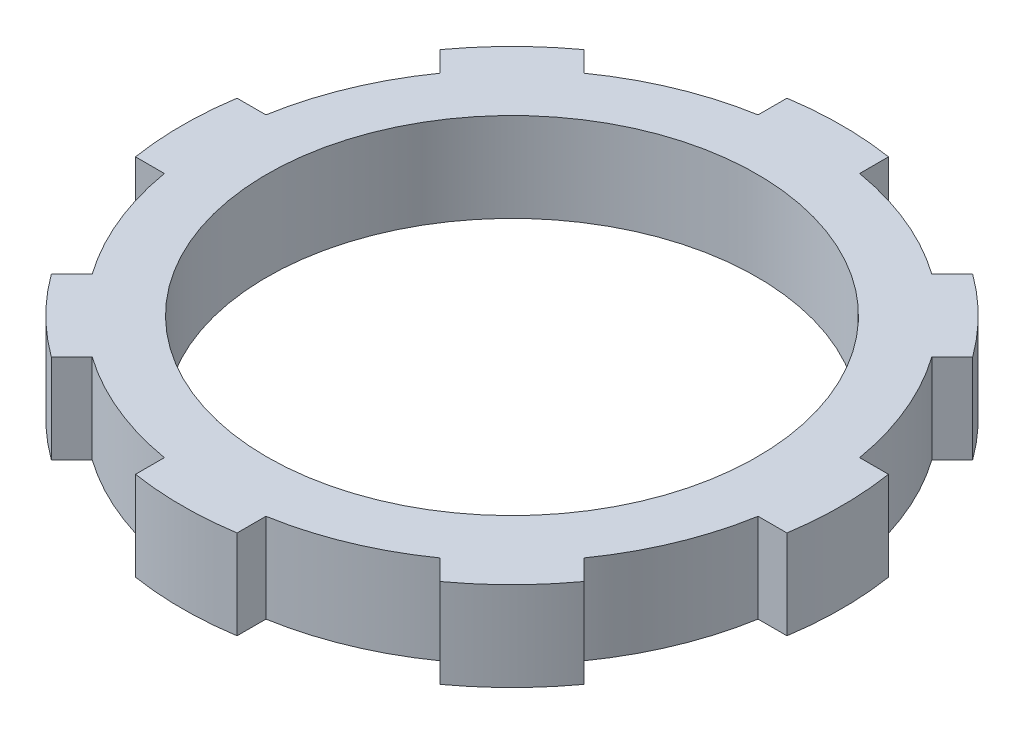
ISO-10303-21;
HEADER;
FILE_DESCRIPTION(('STEP AP214'),'2;1');
FILE_NAME('part.step','',(''),(''),'','','');
FILE_SCHEMA(('AUTOMOTIVE_DESIGN { 1 0 10303 214 1 1 1 1 }'));
ENDSEC;
DATA;
#1=APPLICATION_CONTEXT('core data for automotive mechanical design processes');
#2=APPLICATION_PROTOCOL_DEFINITION('international standard','automotive_design',2000,#1);
#3=PRODUCT_CONTEXT('',#1,'mechanical');
#4=PRODUCT('Part','Part','',(#3));
#5=PRODUCT_RELATED_PRODUCT_CATEGORY('part','',(#4));
#6=PRODUCT_DEFINITION_FORMATION('','',#4);
#7=PRODUCT_DEFINITION_CONTEXT('part definition',#1,'design');
#8=PRODUCT_DEFINITION('design','',#6,#7);
#9=PRODUCT_DEFINITION_SHAPE('','',#8);
#10=(LENGTH_UNIT() NAMED_UNIT(*) SI_UNIT(.MILLI.,.METRE.));
#11=(NAMED_UNIT(*) PLANE_ANGLE_UNIT() SI_UNIT($,.RADIAN.));
#12=(NAMED_UNIT(*) SI_UNIT($,.STERADIAN.) SOLID_ANGLE_UNIT());
#13=UNCERTAINTY_MEASURE_WITH_UNIT(LENGTH_MEASURE(1.E-05),#10,'distance_accuracy_value','');
#14=(GEOMETRIC_REPRESENTATION_CONTEXT(3) GLOBAL_UNCERTAINTY_ASSIGNED_CONTEXT((#13)) GLOBAL_UNIT_ASSIGNED_CONTEXT((#10,
#11,#12)) REPRESENTATION_CONTEXT('',''));
#15=CARTESIAN_POINT('',(0.,0.,0.));
#16=DIRECTION('',(0.,0.,1.));
#17=DIRECTION('',(1.,0.,0.));
#18=AXIS2_PLACEMENT_3D('',#15,#16,#17);
#19=CARTESIAN_POINT('',(0.,5.,0.));
#20=DIRECTION('',(0.,1.,0.));
#21=DIRECTION('',(0.,0.,1.));
#22=AXIS2_PLACEMENT_3D('',#19,#20,#21);
#23=PLANE('',#22);
#24=CARTESIAN_POINT('',(0.,5.,0.));
#25=DIRECTION('',(0.,1.,0.));
#26=DIRECTION('',(0.,0.,1.));
#27=AXIS2_PLACEMENT_3D('',#24,#25,#26);
#28=CIRCLE('',#27,18.5);
#29=CARTESIAN_POINT('',(2.85,5.,-18.2791547944646));
#30=VERTEX_POINT('',#29);
#31=CARTESIAN_POINT('',(-2.85,5.,-18.2791547944646));
#32=VERTEX_POINT('',#31);
#33=EDGE_CURVE('E338',#30,#32,#28,.T.);
#34=ORIENTED_EDGE('',*,*,#33,.T.);
#35=DIRECTION('',(0.,0.,1.));
#36=VECTOR('',#35,1.);
#37=CARTESIAN_POINT('',(-2.85,5.,-18.2791547944646));
#38=LINE('',#37,#36);
#39=CARTESIAN_POINT('',(-2.85,5.,-16.6579560570918));
#40=VERTEX_POINT('',#39);
#41=EDGE_CURVE('E166',#32,#40,#38,.T.);
#42=ORIENTED_EDGE('',*,*,#41,.T.);
#43=CARTESIAN_POINT('',(0.,5.,0.));
#44=DIRECTION('',(0.,1.,0.));
#45=DIRECTION('',(0.,0.,1.));
#46=AXIS2_PLACEMENT_3D('',#43,#44,#45);
#47=CIRCLE('',#46,16.9);
#48=CARTESIAN_POINT('',(-9.76369936229545,5.,-13.7942080150588));
#49=VERTEX_POINT('',#48);
#50=EDGE_CURVE('E425',#40,#49,#47,.T.);
#51=ORIENTED_EDGE('',*,*,#50,.T.);
#52=DIRECTION('',(-0.707106781186548,0.,-0.707106781186548));
#53=VECTOR('',#52,1.);
#54=CARTESIAN_POINT('',(-10.9100599831429,5.,-14.9405686359062));
#55=LINE('',#54,#53);
#56=CARTESIAN_POINT('',(-10.9100599831429,5.,-14.9405686359062));
#57=VERTEX_POINT('',#56);
#58=EDGE_CURVE('E444',#49,#57,#55,.T.);
#59=ORIENTED_EDGE('',*,*,#58,.T.);
#60=CARTESIAN_POINT('',(0.,5.,0.));
#61=DIRECTION('',(0.,1.,0.));
#62=DIRECTION('',(0.,0.,1.));
#63=AXIS2_PLACEMENT_3D('',#60,#61,#62);
#64=CIRCLE('',#63,18.5);
#65=CARTESIAN_POINT('',(-14.9405686359062,5.,-10.9100599831429));
#66=VERTEX_POINT('',#65);
#67=EDGE_CURVE('E441',#57,#66,#64,.T.);
#68=ORIENTED_EDGE('',*,*,#67,.T.);
#69=DIRECTION('',(0.707106781186548,0.,0.707106781186548));
#70=VECTOR('',#69,1.);
#71=CARTESIAN_POINT('',(-14.9405686359062,5.,-10.9100599831429));
#72=LINE('',#71,#70);
#73=CARTESIAN_POINT('',(-13.7942080150588,5.,-9.76369936229545));
#74=VERTEX_POINT('',#73);
#75=EDGE_CURVE('E443',#66,#74,#72,.T.);
#76=ORIENTED_EDGE('',*,*,#75,.T.);
#77=CARTESIAN_POINT('',(0.,5.,0.));
#78=DIRECTION('',(0.,1.,0.));
#79=DIRECTION('',(0.,0.,1.));
#80=AXIS2_PLACEMENT_3D('',#77,#78,#79);
#81=CIRCLE('',#80,16.9);
#82=CARTESIAN_POINT('',(-16.6579560570918,5.,-2.85));
#83=VERTEX_POINT('',#82);
#84=EDGE_CURVE('E446',#74,#83,#81,.T.);
#85=ORIENTED_EDGE('',*,*,#84,.T.);
#86=DIRECTION('',(-1.,0.,0.));
#87=VECTOR('',#86,1.);
#88=CARTESIAN_POINT('',(-18.2791547944646,5.,-2.85));
#89=LINE('',#88,#87);
#90=CARTESIAN_POINT('',(-18.2791547944646,5.,-2.85));
#91=VERTEX_POINT('',#90);
#92=EDGE_CURVE('E452',#83,#91,#89,.T.);
#93=ORIENTED_EDGE('',*,*,#92,.T.);
#94=CARTESIAN_POINT('',(0.,5.,0.));
#95=DIRECTION('',(0.,1.,0.));
#96=DIRECTION('',(0.,0.,1.));
#97=AXIS2_PLACEMENT_3D('',#94,#95,#96);
#98=CIRCLE('',#97,18.5);
#99=CARTESIAN_POINT('',(-18.2791547944646,5.,2.85));
#100=VERTEX_POINT('',#99);
#101=EDGE_CURVE('E454',#91,#100,#98,.T.);
#102=ORIENTED_EDGE('',*,*,#101,.T.);
#103=DIRECTION('',(1.,0.,0.));
#104=VECTOR('',#103,1.);
#105=CARTESIAN_POINT('',(-18.2791547944646,5.,2.85));
#106=LINE('',#105,#104);
#107=CARTESIAN_POINT('',(-16.6579560570918,5.,2.85));
#108=VERTEX_POINT('',#107);
#109=EDGE_CURVE('E456',#100,#108,#106,.T.);
#110=ORIENTED_EDGE('',*,*,#109,.T.);
#111=CARTESIAN_POINT('',(0.,5.,0.));
#112=DIRECTION('',(0.,1.,0.));
#113=DIRECTION('',(0.,0.,1.));
#114=AXIS2_PLACEMENT_3D('',#111,#112,#113);
#115=CIRCLE('',#114,16.9);
#116=CARTESIAN_POINT('',(-13.7942080150588,5.,9.76369936229545));
#117=VERTEX_POINT('',#116);
#118=EDGE_CURVE('E458',#108,#117,#115,.T.);
#119=ORIENTED_EDGE('',*,*,#118,.T.);
#120=DIRECTION('',(-0.707106781186548,0.,0.707106781186548));
#121=VECTOR('',#120,1.);
#122=CARTESIAN_POINT('',(-14.9405686359062,5.,10.9100599831429));
#123=LINE('',#122,#121);
#124=CARTESIAN_POINT('',(-14.9405686359062,5.,10.9100599831429));
#125=VERTEX_POINT('',#124);
#126=EDGE_CURVE('E460',#117,#125,#123,.T.);
#127=ORIENTED_EDGE('',*,*,#126,.T.);
#128=CARTESIAN_POINT('',(0.,5.,0.));
#129=DIRECTION('',(0.,1.,0.));
#130=DIRECTION('',(0.,0.,1.));
#131=AXIS2_PLACEMENT_3D('',#128,#129,#130);
#132=CIRCLE('',#131,18.5);
#133=CARTESIAN_POINT('',(-10.9100599831429,5.,14.9405686359062));
#134=VERTEX_POINT('',#133);
#135=EDGE_CURVE('E462',#125,#134,#132,.T.);
#136=ORIENTED_EDGE('',*,*,#135,.T.);
#137=DIRECTION('',(0.707106781186548,0.,-0.707106781186548));
#138=VECTOR('',#137,1.);
#139=CARTESIAN_POINT('',(-10.9100599831429,5.,14.9405686359062));
#140=LINE('',#139,#138);
#141=CARTESIAN_POINT('',(-9.76369936229545,5.,13.7942080150588));
#142=VERTEX_POINT('',#141);
#143=EDGE_CURVE('E464',#134,#142,#140,.T.);
#144=ORIENTED_EDGE('',*,*,#143,.T.);
#145=CARTESIAN_POINT('',(0.,5.,0.));
#146=DIRECTION('',(0.,1.,0.));
#147=DIRECTION('',(0.,0.,1.));
#148=AXIS2_PLACEMENT_3D('',#145,#146,#147);
#149=CIRCLE('',#148,16.9);
#150=CARTESIAN_POINT('',(-2.85,5.,16.6579560570918));
#151=VERTEX_POINT('',#150);
#152=EDGE_CURVE('E466',#142,#151,#149,.T.);
#153=ORIENTED_EDGE('',*,*,#152,.T.);
#154=DIRECTION('',(0.,0.,1.));
#155=VECTOR('',#154,1.);
#156=CARTESIAN_POINT('',(-2.85,5.,18.2791547944646));
#157=LINE('',#156,#155);
#158=CARTESIAN_POINT('',(-2.85,5.,18.2791547944646));
#159=VERTEX_POINT('',#158);
#160=EDGE_CURVE('E468',#151,#159,#157,.T.);
#161=ORIENTED_EDGE('',*,*,#160,.T.);
#162=CARTESIAN_POINT('',(0.,5.,0.));
#163=DIRECTION('',(0.,1.,0.));
#164=DIRECTION('',(0.,0.,1.));
#165=AXIS2_PLACEMENT_3D('',#162,#163,#164);
#166=CIRCLE('',#165,18.5);
#167=CARTESIAN_POINT('',(2.85,5.,18.2791547944646));
#168=VERTEX_POINT('',#167);
#169=EDGE_CURVE('E470',#159,#168,#166,.T.);
#170=ORIENTED_EDGE('',*,*,#169,.T.);
#171=DIRECTION('',(0.,0.,-1.));
#172=VECTOR('',#171,1.);
#173=CARTESIAN_POINT('',(2.85,5.,18.2791547944646));
#174=LINE('',#173,#172);
#175=CARTESIAN_POINT('',(2.85,5.,16.6579560570918));
#176=VERTEX_POINT('',#175);
#177=EDGE_CURVE('E472',#168,#176,#174,.T.);
#178=ORIENTED_EDGE('',*,*,#177,.T.);
#179=CARTESIAN_POINT('',(0.,5.,0.));
#180=DIRECTION('',(0.,1.,0.));
#181=DIRECTION('',(0.,0.,1.));
#182=AXIS2_PLACEMENT_3D('',#179,#180,#181);
#183=CIRCLE('',#182,16.9);
#184=CARTESIAN_POINT('',(9.76369936229544,5.,13.7942080150588));
#185=VERTEX_POINT('',#184);
#186=EDGE_CURVE('E474',#176,#185,#183,.T.);
#187=ORIENTED_EDGE('',*,*,#186,.T.);
#188=DIRECTION('',(0.707106781186548,0.,0.707106781186548));
#189=VECTOR('',#188,1.);
#190=CARTESIAN_POINT('',(10.9100599831429,5.,14.9405686359062));
#191=LINE('',#190,#189);
#192=CARTESIAN_POINT('',(10.9100599831429,5.,14.9405686359062));
#193=VERTEX_POINT('',#192);
#194=EDGE_CURVE('E476',#185,#193,#191,.T.);
#195=ORIENTED_EDGE('',*,*,#194,.T.);
#196=CARTESIAN_POINT('',(0.,5.,0.));
#197=DIRECTION('',(0.,1.,0.));
#198=DIRECTION('',(0.,0.,1.));
#199=AXIS2_PLACEMENT_3D('',#196,#197,#198);
#200=CIRCLE('',#199,18.5);
#201=CARTESIAN_POINT('',(14.9405686359062,5.,10.9100599831429));
#202=VERTEX_POINT('',#201);
#203=EDGE_CURVE('E478',#193,#202,#200,.T.);
#204=ORIENTED_EDGE('',*,*,#203,.T.);
#205=DIRECTION('',(-0.707106781186548,0.,-0.707106781186548));
#206=VECTOR('',#205,1.);
#207=CARTESIAN_POINT('',(14.9405686359062,5.,10.9100599831429));
#208=LINE('',#207,#206);
#209=CARTESIAN_POINT('',(13.7942080150588,5.,9.76369936229544));
#210=VERTEX_POINT('',#209);
#211=EDGE_CURVE('E480',#202,#210,#208,.T.);
#212=ORIENTED_EDGE('',*,*,#211,.T.);
#213=CARTESIAN_POINT('',(0.,5.,0.));
#214=DIRECTION('',(0.,1.,0.));
#215=DIRECTION('',(0.,0.,1.));
#216=AXIS2_PLACEMENT_3D('',#213,#214,#215);
#217=CIRCLE('',#216,16.9);
#218=CARTESIAN_POINT('',(16.6579560570918,5.,2.85));
#219=VERTEX_POINT('',#218);
#220=EDGE_CURVE('E482',#210,#219,#217,.T.);
#221=ORIENTED_EDGE('',*,*,#220,.T.);
#222=DIRECTION('',(1.,0.,0.));
#223=VECTOR('',#222,1.);
#224=CARTESIAN_POINT('',(18.2791547944646,5.,2.85));
#225=LINE('',#224,#223);
#226=CARTESIAN_POINT('',(18.2791547944646,5.,2.85));
#227=VERTEX_POINT('',#226);
#228=EDGE_CURVE('E484',#219,#227,#225,.T.);
#229=ORIENTED_EDGE('',*,*,#228,.T.);
#230=CARTESIAN_POINT('',(0.,5.,0.));
#231=DIRECTION('',(0.,1.,0.));
#232=DIRECTION('',(0.,0.,1.));
#233=AXIS2_PLACEMENT_3D('',#230,#231,#232);
#234=CIRCLE('',#233,18.5);
#235=CARTESIAN_POINT('',(18.2791547944646,5.,-2.85));
#236=VERTEX_POINT('',#235);
#237=EDGE_CURVE('E486',#227,#236,#234,.T.);
#238=ORIENTED_EDGE('',*,*,#237,.T.);
#239=DIRECTION('',(-1.,0.,0.));
#240=VECTOR('',#239,1.);
#241=CARTESIAN_POINT('',(18.2791547944646,5.,-2.85));
#242=LINE('',#241,#240);
#243=CARTESIAN_POINT('',(16.6579560570918,5.,-2.85));
#244=VERTEX_POINT('',#243);
#245=EDGE_CURVE('E488',#236,#244,#242,.T.);
#246=ORIENTED_EDGE('',*,*,#245,.T.);
#247=CARTESIAN_POINT('',(0.,5.,0.));
#248=DIRECTION('',(0.,1.,0.));
#249=DIRECTION('',(0.,0.,1.));
#250=AXIS2_PLACEMENT_3D('',#247,#248,#249);
#251=CIRCLE('',#250,16.9);
#252=CARTESIAN_POINT('',(13.7942080150588,5.,-9.76369936229544));
#253=VERTEX_POINT('',#252);
#254=EDGE_CURVE('E490',#244,#253,#251,.T.);
#255=ORIENTED_EDGE('',*,*,#254,.T.);
#256=DIRECTION('',(0.707106781186548,0.,-0.707106781186548));
#257=VECTOR('',#256,1.);
#258=CARTESIAN_POINT('',(14.9405686359062,5.,-10.9100599831429));
#259=LINE('',#258,#257);
#260=CARTESIAN_POINT('',(14.9405686359062,5.,-10.9100599831429));
#261=VERTEX_POINT('',#260);
#262=EDGE_CURVE('E492',#253,#261,#259,.T.);
#263=ORIENTED_EDGE('',*,*,#262,.T.);
#264=CARTESIAN_POINT('',(0.,5.,0.));
#265=DIRECTION('',(0.,1.,0.));
#266=DIRECTION('',(0.,0.,1.));
#267=AXIS2_PLACEMENT_3D('',#264,#265,#266);
#268=CIRCLE('',#267,18.5);
#269=CARTESIAN_POINT('',(10.9100599831429,5.,-14.9405686359062));
#270=VERTEX_POINT('',#269);
#271=EDGE_CURVE('E257',#261,#270,#268,.T.);
#272=ORIENTED_EDGE('',*,*,#271,.T.);
#273=DIRECTION('',(-0.707106781186548,0.,0.707106781186548));
#274=VECTOR('',#273,1.);
#275=CARTESIAN_POINT('',(10.9100599831429,5.,-14.9405686359062));
#276=LINE('',#275,#274);
#277=CARTESIAN_POINT('',(9.76369936229544,5.,-13.7942080150588));
#278=VERTEX_POINT('',#277);
#279=EDGE_CURVE('E251',#270,#278,#276,.T.);
#280=ORIENTED_EDGE('',*,*,#279,.T.);
#281=CARTESIAN_POINT('',(0.,5.,0.));
#282=DIRECTION('',(0.,1.,0.));
#283=DIRECTION('',(0.,0.,1.));
#284=AXIS2_PLACEMENT_3D('',#281,#282,#283);
#285=CIRCLE('',#284,16.9);
#286=CARTESIAN_POINT('',(2.85,5.,-16.6579560570918));
#287=VERTEX_POINT('',#286);
#288=EDGE_CURVE('E255',#278,#287,#285,.T.);
#289=ORIENTED_EDGE('',*,*,#288,.T.);
#290=DIRECTION('',(0.,0.,-1.));
#291=VECTOR('',#290,1.);
#292=CARTESIAN_POINT('',(2.85,5.,-18.2791547944646));
#293=LINE('',#292,#291);
#294=EDGE_CURVE('E51',#287,#30,#293,.T.);
#295=ORIENTED_EDGE('',*,*,#294,.T.);
#296=EDGE_LOOP('',(#34,#42,#51,#59,#68,#76,#85,#93,#102,#110,#119,#127,#136,#144,#153,#161,#170,
#178,#187,#195,#204,#212,#221,#229,#238,#246,#255,#263,#272,#280,#289,#295));
#297=FACE_BOUND('',#296,.T.);
#298=CARTESIAN_POINT('',(0.,5.,0.));
#299=DIRECTION('',(0.,1.,0.));
#300=DIRECTION('',(0.,0.,1.));
#301=AXIS2_PLACEMENT_3D('',#298,#299,#300);
#302=CIRCLE('',#301,13.75);
#303=CARTESIAN_POINT('',(0.,5.,13.75));
#304=VERTEX_POINT('',#303);
#305=EDGE_CURVE('E279',#304,#304,#302,.T.);
#306=ORIENTED_EDGE('',*,*,#305,.F.);
#307=EDGE_LOOP('',(#306));
#308=FACE_BOUND('',#307,.T.);
#309=ADVANCED_FACE('F34',(#297,#308),#23,.T.);
#310=CARTESIAN_POINT('',(0.,0.,0.));
#311=DIRECTION('',(0.,1.,0.));
#312=DIRECTION('',(0.,0.,1.));
#313=AXIS2_PLACEMENT_3D('',#310,#311,#312);
#314=PLANE('',#313);
#315=CARTESIAN_POINT('',(0.,0.,0.));
#316=DIRECTION('',(0.,1.,0.));
#317=DIRECTION('',(0.,0.,1.));
#318=AXIS2_PLACEMENT_3D('',#315,#316,#317);
#319=CIRCLE('',#318,18.5);
#320=CARTESIAN_POINT('',(2.85,0.,-18.2791547944646));
#321=VERTEX_POINT('',#320);
#322=CARTESIAN_POINT('',(-2.85,0.,-18.2791547944646));
#323=VERTEX_POINT('',#322);
#324=EDGE_CURVE('E275',#321,#323,#319,.T.);
#325=ORIENTED_EDGE('',*,*,#324,.F.);
#326=DIRECTION('',(0.,0.,-1.));
#327=VECTOR('',#326,1.);
#328=CARTESIAN_POINT('',(2.85,0.,-18.2791547944646));
#329=LINE('',#328,#327);
#330=CARTESIAN_POINT('',(2.85,0.,-16.6579560570918));
#331=VERTEX_POINT('',#330);
#332=EDGE_CURVE('E158',#331,#321,#329,.T.);
#333=ORIENTED_EDGE('',*,*,#332,.F.);
#334=CARTESIAN_POINT('',(0.,0.,0.));
#335=DIRECTION('',(0.,1.,0.));
#336=DIRECTION('',(0.,0.,1.));
#337=AXIS2_PLACEMENT_3D('',#334,#335,#336);
#338=CIRCLE('',#337,16.9);
#339=CARTESIAN_POINT('',(9.76369936229544,0.,-13.7942080150588));
#340=VERTEX_POINT('',#339);
#341=EDGE_CURVE('E152',#340,#331,#338,.T.);
#342=ORIENTED_EDGE('',*,*,#341,.F.);
#343=DIRECTION('',(-0.707106781186548,0.,0.707106781186548));
#344=VECTOR('',#343,1.);
#345=CARTESIAN_POINT('',(10.9100599831429,0.,-14.9405686359062));
#346=LINE('',#345,#344);
#347=CARTESIAN_POINT('',(10.9100599831429,0.,-14.9405686359062));
#348=VERTEX_POINT('',#347);
#349=EDGE_CURVE('E265',#348,#340,#346,.T.);
#350=ORIENTED_EDGE('',*,*,#349,.F.);
#351=CARTESIAN_POINT('',(0.,0.,0.));
#352=DIRECTION('',(0.,1.,0.));
#353=DIRECTION('',(0.,0.,1.));
#354=AXIS2_PLACEMENT_3D('',#351,#352,#353);
#355=CIRCLE('',#354,18.5);
#356=CARTESIAN_POINT('',(14.9405686359062,0.,-10.9100599831429));
#357=VERTEX_POINT('',#356);
#358=EDGE_CURVE('E333',#357,#348,#355,.T.);
#359=ORIENTED_EDGE('',*,*,#358,.F.);
#360=DIRECTION('',(0.707106781186548,0.,-0.707106781186548));
#361=VECTOR('',#360,1.);
#362=CARTESIAN_POINT('',(14.9405686359062,0.,-10.9100599831429));
#363=LINE('',#362,#361);
#364=CARTESIAN_POINT('',(13.7942080150588,0.,-9.76369936229544));
#365=VERTEX_POINT('',#364);
#366=EDGE_CURVE('E331',#365,#357,#363,.T.);
#367=ORIENTED_EDGE('',*,*,#366,.F.);
#368=CARTESIAN_POINT('',(0.,0.,0.));
#369=DIRECTION('',(0.,1.,0.));
#370=DIRECTION('',(0.,0.,1.));
#371=AXIS2_PLACEMENT_3D('',#368,#369,#370);
#372=CIRCLE('',#371,16.9);
#373=CARTESIAN_POINT('',(16.6579560570918,0.,-2.85));
#374=VERTEX_POINT('',#373);
#375=EDGE_CURVE('E329',#374,#365,#372,.T.);
#376=ORIENTED_EDGE('',*,*,#375,.F.);
#377=DIRECTION('',(-1.,0.,0.));
#378=VECTOR('',#377,1.);
#379=CARTESIAN_POINT('',(18.2791547944646,0.,-2.85));
#380=LINE('',#379,#378);
#381=CARTESIAN_POINT('',(18.2791547944646,0.,-2.85));
#382=VERTEX_POINT('',#381);
#383=EDGE_CURVE('E327',#382,#374,#380,.T.);
#384=ORIENTED_EDGE('',*,*,#383,.F.);
#385=CARTESIAN_POINT('',(0.,0.,0.));
#386=DIRECTION('',(0.,1.,0.));
#387=DIRECTION('',(0.,0.,1.));
#388=AXIS2_PLACEMENT_3D('',#385,#386,#387);
#389=CIRCLE('',#388,18.5);
#390=CARTESIAN_POINT('',(18.2791547944646,0.,2.85));
#391=VERTEX_POINT('',#390);
#392=EDGE_CURVE('E325',#391,#382,#389,.T.);
#393=ORIENTED_EDGE('',*,*,#392,.F.);
#394=DIRECTION('',(1.,0.,0.));
#395=VECTOR('',#394,1.);
#396=CARTESIAN_POINT('',(18.2791547944646,0.,2.85));
#397=LINE('',#396,#395);
#398=CARTESIAN_POINT('',(16.6579560570918,0.,2.85));
#399=VERTEX_POINT('',#398);
#400=EDGE_CURVE('E323',#399,#391,#397,.T.);
#401=ORIENTED_EDGE('',*,*,#400,.F.);
#402=CARTESIAN_POINT('',(0.,0.,0.));
#403=DIRECTION('',(0.,1.,0.));
#404=DIRECTION('',(0.,0.,1.));
#405=AXIS2_PLACEMENT_3D('',#402,#403,#404);
#406=CIRCLE('',#405,16.9);
#407=CARTESIAN_POINT('',(13.7942080150588,0.,9.76369936229544));
#408=VERTEX_POINT('',#407);
#409=EDGE_CURVE('E321',#408,#399,#406,.T.);
#410=ORIENTED_EDGE('',*,*,#409,.F.);
#411=DIRECTION('',(-0.707106781186548,0.,-0.707106781186548));
#412=VECTOR('',#411,1.);
#413=CARTESIAN_POINT('',(14.9405686359062,0.,10.9100599831429));
#414=LINE('',#413,#412);
#415=CARTESIAN_POINT('',(14.9405686359062,0.,10.9100599831429));
#416=VERTEX_POINT('',#415);
#417=EDGE_CURVE('E319',#416,#408,#414,.T.);
#418=ORIENTED_EDGE('',*,*,#417,.F.);
#419=CARTESIAN_POINT('',(0.,0.,0.));
#420=DIRECTION('',(0.,1.,0.));
#421=DIRECTION('',(0.,0.,1.));
#422=AXIS2_PLACEMENT_3D('',#419,#420,#421);
#423=CIRCLE('',#422,18.5);
#424=CARTESIAN_POINT('',(10.9100599831429,0.,14.9405686359062));
#425=VERTEX_POINT('',#424);
#426=EDGE_CURVE('E317',#425,#416,#423,.T.);
#427=ORIENTED_EDGE('',*,*,#426,.F.);
#428=DIRECTION('',(0.707106781186548,0.,0.707106781186548));
#429=VECTOR('',#428,1.);
#430=CARTESIAN_POINT('',(10.9100599831429,0.,14.9405686359062));
#431=LINE('',#430,#429);
#432=CARTESIAN_POINT('',(9.76369936229544,0.,13.7942080150588));
#433=VERTEX_POINT('',#432);
#434=EDGE_CURVE('E315',#433,#425,#431,.T.);
#435=ORIENTED_EDGE('',*,*,#434,.F.);
#436=CARTESIAN_POINT('',(0.,0.,0.));
#437=DIRECTION('',(0.,1.,0.));
#438=DIRECTION('',(0.,0.,1.));
#439=AXIS2_PLACEMENT_3D('',#436,#437,#438);
#440=CIRCLE('',#439,16.9);
#441=CARTESIAN_POINT('',(2.85,0.,16.6579560570918));
#442=VERTEX_POINT('',#441);
#443=EDGE_CURVE('E313',#442,#433,#440,.T.);
#444=ORIENTED_EDGE('',*,*,#443,.F.);
#445=DIRECTION('',(0.,0.,-1.));
#446=VECTOR('',#445,1.);
#447=CARTESIAN_POINT('',(2.85,0.,18.2791547944646));
#448=LINE('',#447,#446);
#449=CARTESIAN_POINT('',(2.85,0.,18.2791547944646));
#450=VERTEX_POINT('',#449);
#451=EDGE_CURVE('E311',#450,#442,#448,.T.);
#452=ORIENTED_EDGE('',*,*,#451,.F.);
#453=CARTESIAN_POINT('',(0.,0.,0.));
#454=DIRECTION('',(0.,1.,0.));
#455=DIRECTION('',(0.,0.,1.));
#456=AXIS2_PLACEMENT_3D('',#453,#454,#455);
#457=CIRCLE('',#456,18.5);
#458=CARTESIAN_POINT('',(-2.85,0.,18.2791547944646));
#459=VERTEX_POINT('',#458);
#460=EDGE_CURVE('E309',#459,#450,#457,.T.);
#461=ORIENTED_EDGE('',*,*,#460,.F.);
#462=DIRECTION('',(0.,0.,1.));
#463=VECTOR('',#462,1.);
#464=CARTESIAN_POINT('',(-2.85,0.,18.2791547944646));
#465=LINE('',#464,#463);
#466=CARTESIAN_POINT('',(-2.85,0.,16.6579560570918));
#467=VERTEX_POINT('',#466);
#468=EDGE_CURVE('E307',#467,#459,#465,.T.);
#469=ORIENTED_EDGE('',*,*,#468,.F.);
#470=CARTESIAN_POINT('',(0.,0.,0.));
#471=DIRECTION('',(0.,1.,0.));
#472=DIRECTION('',(0.,0.,1.));
#473=AXIS2_PLACEMENT_3D('',#470,#471,#472);
#474=CIRCLE('',#473,16.9);
#475=CARTESIAN_POINT('',(-9.76369936229545,0.,13.7942080150588));
#476=VERTEX_POINT('',#475);
#477=EDGE_CURVE('E305',#476,#467,#474,.T.);
#478=ORIENTED_EDGE('',*,*,#477,.F.);
#479=DIRECTION('',(0.707106781186548,0.,-0.707106781186548));
#480=VECTOR('',#479,1.);
#481=CARTESIAN_POINT('',(-10.9100599831429,0.,14.9405686359062));
#482=LINE('',#481,#480);
#483=CARTESIAN_POINT('',(-10.9100599831429,0.,14.9405686359062));
#484=VERTEX_POINT('',#483);
#485=EDGE_CURVE('E303',#484,#476,#482,.T.);
#486=ORIENTED_EDGE('',*,*,#485,.F.);
#487=CARTESIAN_POINT('',(0.,0.,0.));
#488=DIRECTION('',(0.,1.,0.));
#489=DIRECTION('',(0.,0.,1.));
#490=AXIS2_PLACEMENT_3D('',#487,#488,#489);
#491=CIRCLE('',#490,18.5);
#492=CARTESIAN_POINT('',(-14.9405686359062,0.,10.9100599831429));
#493=VERTEX_POINT('',#492);
#494=EDGE_CURVE('E301',#493,#484,#491,.T.);
#495=ORIENTED_EDGE('',*,*,#494,.F.);
#496=DIRECTION('',(-0.707106781186548,0.,0.707106781186548));
#497=VECTOR('',#496,1.);
#498=CARTESIAN_POINT('',(-14.9405686359062,0.,10.9100599831429));
#499=LINE('',#498,#497);
#500=CARTESIAN_POINT('',(-13.7942080150588,0.,9.76369936229545));
#501=VERTEX_POINT('',#500);
#502=EDGE_CURVE('E299',#501,#493,#499,.T.);
#503=ORIENTED_EDGE('',*,*,#502,.F.);
#504=CARTESIAN_POINT('',(0.,0.,0.));
#505=DIRECTION('',(0.,1.,0.));
#506=DIRECTION('',(0.,0.,1.));
#507=AXIS2_PLACEMENT_3D('',#504,#505,#506);
#508=CIRCLE('',#507,16.9);
#509=CARTESIAN_POINT('',(-16.6579560570918,0.,2.85));
#510=VERTEX_POINT('',#509);
#511=EDGE_CURVE('E297',#510,#501,#508,.T.);
#512=ORIENTED_EDGE('',*,*,#511,.F.);
#513=DIRECTION('',(1.,0.,0.));
#514=VECTOR('',#513,1.);
#515=CARTESIAN_POINT('',(-18.2791547944646,0.,2.85));
#516=LINE('',#515,#514);
#517=CARTESIAN_POINT('',(-18.2791547944646,0.,2.85));
#518=VERTEX_POINT('',#517);
#519=EDGE_CURVE('E295',#518,#510,#516,.T.);
#520=ORIENTED_EDGE('',*,*,#519,.F.);
#521=CARTESIAN_POINT('',(0.,0.,0.));
#522=DIRECTION('',(0.,1.,0.));
#523=DIRECTION('',(0.,0.,1.));
#524=AXIS2_PLACEMENT_3D('',#521,#522,#523);
#525=CIRCLE('',#524,18.5);
#526=CARTESIAN_POINT('',(-18.2791547944646,0.,-2.85));
#527=VERTEX_POINT('',#526);
#528=EDGE_CURVE('E293',#527,#518,#525,.T.);
#529=ORIENTED_EDGE('',*,*,#528,.F.);
#530=DIRECTION('',(-1.,0.,0.));
#531=VECTOR('',#530,1.);
#532=CARTESIAN_POINT('',(-18.2791547944646,0.,-2.85));
#533=LINE('',#532,#531);
#534=CARTESIAN_POINT('',(-16.6579560570918,0.,-2.85));
#535=VERTEX_POINT('',#534);
#536=EDGE_CURVE('E291',#535,#527,#533,.T.);
#537=ORIENTED_EDGE('',*,*,#536,.F.);
#538=CARTESIAN_POINT('',(0.,0.,0.));
#539=DIRECTION('',(0.,1.,0.));
#540=DIRECTION('',(0.,0.,1.));
#541=AXIS2_PLACEMENT_3D('',#538,#539,#540);
#542=CIRCLE('',#541,16.9);
#543=CARTESIAN_POINT('',(-13.7942080150588,0.,-9.76369936229545));
#544=VERTEX_POINT('',#543);
#545=EDGE_CURVE('E289',#544,#535,#542,.T.);
#546=ORIENTED_EDGE('',*,*,#545,.F.);
#547=DIRECTION('',(0.707106781186548,0.,0.707106781186548));
#548=VECTOR('',#547,1.);
#549=CARTESIAN_POINT('',(-14.9405686359062,0.,-10.9100599831429));
#550=LINE('',#549,#548);
#551=CARTESIAN_POINT('',(-14.9405686359062,0.,-10.9100599831429));
#552=VERTEX_POINT('',#551);
#553=EDGE_CURVE('E287',#552,#544,#550,.T.);
#554=ORIENTED_EDGE('',*,*,#553,.F.);
#555=CARTESIAN_POINT('',(0.,0.,0.));
#556=DIRECTION('',(0.,1.,0.));
#557=DIRECTION('',(0.,0.,1.));
#558=AXIS2_PLACEMENT_3D('',#555,#556,#557);
#559=CIRCLE('',#558,18.5);
#560=CARTESIAN_POINT('',(-10.9100599831429,0.,-14.9405686359062));
#561=VERTEX_POINT('',#560);
#562=EDGE_CURVE('E285',#561,#552,#559,.T.);
#563=ORIENTED_EDGE('',*,*,#562,.F.);
#564=DIRECTION('',(-0.707106781186548,0.,-0.707106781186548));
#565=VECTOR('',#564,1.);
#566=CARTESIAN_POINT('',(-10.9100599831429,0.,-14.9405686359062));
#567=LINE('',#566,#565);
#568=CARTESIAN_POINT('',(-9.76369936229545,0.,-13.7942080150588));
#569=VERTEX_POINT('',#568);
#570=EDGE_CURVE('E283',#569,#561,#567,.T.);
#571=ORIENTED_EDGE('',*,*,#570,.F.);
#572=CARTESIAN_POINT('',(0.,0.,0.));
#573=DIRECTION('',(0.,1.,0.));
#574=DIRECTION('',(0.,0.,1.));
#575=AXIS2_PLACEMENT_3D('',#572,#573,#574);
#576=CIRCLE('',#575,16.9);
#577=CARTESIAN_POINT('',(-2.85,0.,-16.6579560570918));
#578=VERTEX_POINT('',#577);
#579=EDGE_CURVE('E281',#578,#569,#576,.T.);
#580=ORIENTED_EDGE('',*,*,#579,.F.);
#581=DIRECTION('',(0.,0.,1.));
#582=VECTOR('',#581,1.);
#583=CARTESIAN_POINT('',(-2.85,0.,-18.2791547944646));
#584=LINE('',#583,#582);
#585=EDGE_CURVE('E278',#323,#578,#584,.T.);
#586=ORIENTED_EDGE('',*,*,#585,.F.);
#587=EDGE_LOOP('',(#325,#333,#342,#350,#359,#367,#376,#384,#393,#401,#410,#418,#427,#435,#444,
#452,#461,#469,#478,#486,#495,#503,#512,#520,#529,#537,#546,#554,#563,#571,#580,#586));
#588=FACE_BOUND('',#587,.T.);
#589=CARTESIAN_POINT('',(0.,0.,0.));
#590=DIRECTION('',(0.,1.,0.));
#591=DIRECTION('',(0.,0.,1.));
#592=AXIS2_PLACEMENT_3D('',#589,#590,#591);
#593=CIRCLE('',#592,13.75);
#594=CARTESIAN_POINT('',(0.,0.,13.75));
#595=VERTEX_POINT('',#594);
#596=EDGE_CURVE('E899',#595,#595,#593,.T.);
#597=ORIENTED_EDGE('',*,*,#596,.T.);
#598=EDGE_LOOP('',(#597));
#599=FACE_BOUND('',#598,.T.);
#600=ADVANCED_FACE('F429',(#588,#599),#314,.F.);
#601=CARTESIAN_POINT('',(0.,5.,0.));
#602=DIRECTION('',(0.,-1.,0.));
#603=DIRECTION('',(0.,0.,-1.));
#604=AXIS2_PLACEMENT_3D('',#601,#602,#603);
#605=CYLINDRICAL_SURFACE('',#604,18.5);
#606=ORIENTED_EDGE('',*,*,#324,.T.);
#607=DIRECTION('',(0.,-1.,0.));
#608=VECTOR('',#607,1.);
#609=CARTESIAN_POINT('',(-2.85,5.,-18.2791547944646));
#610=LINE('',#609,#608);
#611=EDGE_CURVE('E11',#32,#323,#610,.T.);
#612=ORIENTED_EDGE('',*,*,#611,.F.);
#613=ORIENTED_EDGE('',*,*,#33,.F.);
#614=DIRECTION('',(0.,-1.,0.));
#615=VECTOR('',#614,1.);
#616=CARTESIAN_POINT('',(2.85,5.,-18.2791547944646));
#617=LINE('',#616,#615);
#618=EDGE_CURVE('E271',#30,#321,#617,.T.);
#619=ORIENTED_EDGE('',*,*,#618,.T.);
#620=EDGE_LOOP('',(#606,#612,#613,#619));
#621=FACE_BOUND('',#620,.T.);
#622=ADVANCED_FACE('F36',(#621),#605,.T.);
#623=CARTESIAN_POINT('',(-2.85,5.,-18.2791547944646));
#624=DIRECTION('',(1.,0.,0.));
#625=DIRECTION('',(0.,0.,-1.));
#626=AXIS2_PLACEMENT_3D('',#623,#624,#625);
#627=PLANE('',#626);
#628=ORIENTED_EDGE('',*,*,#585,.T.);
#629=DIRECTION('',(0.,-1.,0.));
#630=VECTOR('',#629,1.);
#631=CARTESIAN_POINT('',(-2.85,5.,-16.6579560570918));
#632=LINE('',#631,#630);
#633=EDGE_CURVE('E43',#40,#578,#632,.T.);
#634=ORIENTED_EDGE('',*,*,#633,.F.);
#635=ORIENTED_EDGE('',*,*,#41,.F.);
#636=ORIENTED_EDGE('',*,*,#611,.T.);
#637=EDGE_LOOP('',(#628,#634,#635,#636));
#638=FACE_BOUND('',#637,.T.);
#639=ADVANCED_FACE('F526',(#638),#627,.F.);
#640=CARTESIAN_POINT('',(0.,5.,0.));
#641=DIRECTION('',(0.,-1.,0.));
#642=DIRECTION('',(0.,0.,-1.));
#643=AXIS2_PLACEMENT_3D('',#640,#641,#642);
#644=CYLINDRICAL_SURFACE('',#643,16.9);
#645=ORIENTED_EDGE('',*,*,#579,.T.);
#646=DIRECTION('',(0.,-1.,0.));
#647=VECTOR('',#646,1.);
#648=CARTESIAN_POINT('',(-9.76369936229545,5.,-13.7942080150588));
#649=LINE('',#648,#647);
#650=EDGE_CURVE('E417',#49,#569,#649,.T.);
#651=ORIENTED_EDGE('',*,*,#650,.F.);
#652=ORIENTED_EDGE('',*,*,#50,.F.);
#653=ORIENTED_EDGE('',*,*,#633,.T.);
#654=EDGE_LOOP('',(#645,#651,#652,#653));
#655=FACE_BOUND('',#654,.T.);
#656=ADVANCED_FACE('F423',(#655),#644,.T.);
#657=CARTESIAN_POINT('',(-10.9100599831429,5.,-14.9405686359062));
#658=DIRECTION('',(-0.707106781186548,0.,0.707106781186548));
#659=DIRECTION('',(0.707106781186548,0.,0.707106781186548));
#660=AXIS2_PLACEMENT_3D('',#657,#658,#659);
#661=PLANE('',#660);
#662=ORIENTED_EDGE('',*,*,#570,.T.);
#663=DIRECTION('',(0.,-1.,0.));
#664=VECTOR('',#663,1.);
#665=CARTESIAN_POINT('',(-10.9100599831429,5.,-14.9405686359062));
#666=LINE('',#665,#664);
#667=EDGE_CURVE('E414',#57,#561,#666,.T.);
#668=ORIENTED_EDGE('',*,*,#667,.F.);
#669=ORIENTED_EDGE('',*,*,#58,.F.);
#670=ORIENTED_EDGE('',*,*,#650,.T.);
#671=EDGE_LOOP('',(#662,#668,#669,#670));
#672=FACE_BOUND('',#671,.T.);
#673=ADVANCED_FACE('F435',(#672),#661,.F.);
#674=CARTESIAN_POINT('',(0.,5.,0.));
#675=DIRECTION('',(0.,-1.,0.));
#676=DIRECTION('',(0.,0.,-1.));
#677=AXIS2_PLACEMENT_3D('',#674,#675,#676);
#678=CYLINDRICAL_SURFACE('',#677,18.5);
#679=ORIENTED_EDGE('',*,*,#562,.T.);
#680=DIRECTION('',(0.,-1.,0.));
#681=VECTOR('',#680,1.);
#682=CARTESIAN_POINT('',(-14.9405686359062,5.,-10.9100599831429));
#683=LINE('',#682,#681);
#684=EDGE_CURVE('E411',#66,#552,#683,.T.);
#685=ORIENTED_EDGE('',*,*,#684,.F.);
#686=ORIENTED_EDGE('',*,*,#67,.F.);
#687=ORIENTED_EDGE('',*,*,#667,.T.);
#688=EDGE_LOOP('',(#679,#685,#686,#687));
#689=FACE_BOUND('',#688,.T.);
#690=ADVANCED_FACE('F439',(#689),#678,.T.);
#691=CARTESIAN_POINT('',(-14.9405686359062,5.,-10.9100599831429));
#692=DIRECTION('',(0.707106781186548,0.,-0.707106781186548));
#693=DIRECTION('',(-0.707106781186548,0.,-0.707106781186548));
#694=AXIS2_PLACEMENT_3D('',#691,#692,#693);
#695=PLANE('',#694);
#696=ORIENTED_EDGE('',*,*,#553,.T.);
#697=DIRECTION('',(0.,-1.,0.));
#698=VECTOR('',#697,1.);
#699=CARTESIAN_POINT('',(-13.7942080150588,5.,-9.76369936229545));
#700=LINE('',#699,#698);
#701=EDGE_CURVE('E408',#74,#544,#700,.T.);
#702=ORIENTED_EDGE('',*,*,#701,.F.);
#703=ORIENTED_EDGE('',*,*,#75,.F.);
#704=ORIENTED_EDGE('',*,*,#684,.T.);
#705=EDGE_LOOP('',(#696,#702,#703,#704));
#706=FACE_BOUND('',#705,.T.);
#707=ADVANCED_FACE('F539',(#706),#695,.F.);
#708=CARTESIAN_POINT('',(0.,5.,0.));
#709=DIRECTION('',(0.,-1.,0.));
#710=DIRECTION('',(0.,0.,-1.));
#711=AXIS2_PLACEMENT_3D('',#708,#709,#710);
#712=CYLINDRICAL_SURFACE('',#711,16.9);
#713=ORIENTED_EDGE('',*,*,#545,.T.);
#714=DIRECTION('',(0.,-1.,0.));
#715=VECTOR('',#714,1.);
#716=CARTESIAN_POINT('',(-16.6579560570918,5.,-2.85));
#717=LINE('',#716,#715);
#718=EDGE_CURVE('E405',#83,#535,#717,.T.);
#719=ORIENTED_EDGE('',*,*,#718,.F.);
#720=ORIENTED_EDGE('',*,*,#84,.F.);
#721=ORIENTED_EDGE('',*,*,#701,.T.);
#722=EDGE_LOOP('',(#713,#719,#720,#721));
#723=FACE_BOUND('',#722,.T.);
#724=ADVANCED_FACE('F542',(#723),#712,.T.);
#725=CARTESIAN_POINT('',(-18.2791547944646,5.,-2.85));
#726=DIRECTION('',(0.,0.,1.));
#727=DIRECTION('',(1.,0.,0.));
#728=AXIS2_PLACEMENT_3D('',#725,#726,#727);
#729=PLANE('',#728);
#730=ORIENTED_EDGE('',*,*,#536,.T.);
#731=DIRECTION('',(0.,-1.,0.));
#732=VECTOR('',#731,1.);
#733=CARTESIAN_POINT('',(-18.2791547944646,5.,-2.85));
#734=LINE('',#733,#732);
#735=EDGE_CURVE('E402',#91,#527,#734,.T.);
#736=ORIENTED_EDGE('',*,*,#735,.F.);
#737=ORIENTED_EDGE('',*,*,#92,.F.);
#738=ORIENTED_EDGE('',*,*,#718,.T.);
#739=EDGE_LOOP('',(#730,#736,#737,#738));
#740=FACE_BOUND('',#739,.T.);
#741=ADVANCED_FACE('F546',(#740),#729,.F.);
#742=CARTESIAN_POINT('',(0.,5.,0.));
#743=DIRECTION('',(0.,-1.,0.));
#744=DIRECTION('',(0.,0.,-1.));
#745=AXIS2_PLACEMENT_3D('',#742,#743,#744);
#746=CYLINDRICAL_SURFACE('',#745,18.5);
#747=ORIENTED_EDGE('',*,*,#528,.T.);
#748=DIRECTION('',(0.,-1.,0.));
#749=VECTOR('',#748,1.);
#750=CARTESIAN_POINT('',(-18.2791547944646,5.,2.85));
#751=LINE('',#750,#749);
#752=EDGE_CURVE('E399',#100,#518,#751,.T.);
#753=ORIENTED_EDGE('',*,*,#752,.F.);
#754=ORIENTED_EDGE('',*,*,#101,.F.);
#755=ORIENTED_EDGE('',*,*,#735,.T.);
#756=EDGE_LOOP('',(#747,#753,#754,#755));
#757=FACE_BOUND('',#756,.T.);
#758=ADVANCED_FACE('F550',(#757),#746,.T.);
#759=CARTESIAN_POINT('',(-18.2791547944646,5.,2.85));
#760=DIRECTION('',(0.,0.,-1.));
#761=DIRECTION('',(-1.,0.,0.));
#762=AXIS2_PLACEMENT_3D('',#759,#760,#761);
#763=PLANE('',#762);
#764=ORIENTED_EDGE('',*,*,#519,.T.);
#765=DIRECTION('',(0.,-1.,0.));
#766=VECTOR('',#765,1.);
#767=CARTESIAN_POINT('',(-16.6579560570918,5.,2.85));
#768=LINE('',#767,#766);
#769=EDGE_CURVE('E396',#108,#510,#768,.T.);
#770=ORIENTED_EDGE('',*,*,#769,.F.);
#771=ORIENTED_EDGE('',*,*,#109,.F.);
#772=ORIENTED_EDGE('',*,*,#752,.T.);
#773=EDGE_LOOP('',(#764,#770,#771,#772));
#774=FACE_BOUND('',#773,.T.);
#775=ADVANCED_FACE('F554',(#774),#763,.F.);
#776=CARTESIAN_POINT('',(0.,5.,0.));
#777=DIRECTION('',(0.,-1.,0.));
#778=DIRECTION('',(0.,0.,-1.));
#779=AXIS2_PLACEMENT_3D('',#776,#777,#778);
#780=CYLINDRICAL_SURFACE('',#779,16.9);
#781=ORIENTED_EDGE('',*,*,#511,.T.);
#782=DIRECTION('',(0.,-1.,0.));
#783=VECTOR('',#782,1.);
#784=CARTESIAN_POINT('',(-13.7942080150588,5.,9.76369936229545));
#785=LINE('',#784,#783);
#786=EDGE_CURVE('E393',#117,#501,#785,.T.);
#787=ORIENTED_EDGE('',*,*,#786,.F.);
#788=ORIENTED_EDGE('',*,*,#118,.F.);
#789=ORIENTED_EDGE('',*,*,#769,.T.);
#790=EDGE_LOOP('',(#781,#787,#788,#789));
#791=FACE_BOUND('',#790,.T.);
#792=ADVANCED_FACE('F558',(#791),#780,.T.);
#793=CARTESIAN_POINT('',(-14.9405686359062,5.,10.9100599831429));
#794=DIRECTION('',(0.707106781186548,0.,0.707106781186548));
#795=DIRECTION('',(0.707106781186548,0.,-0.707106781186548));
#796=AXIS2_PLACEMENT_3D('',#793,#794,#795);
#797=PLANE('',#796);
#798=ORIENTED_EDGE('',*,*,#502,.T.);
#799=DIRECTION('',(0.,-1.,0.));
#800=VECTOR('',#799,1.);
#801=CARTESIAN_POINT('',(-14.9405686359062,5.,10.9100599831429));
#802=LINE('',#801,#800);
#803=EDGE_CURVE('E390',#125,#493,#802,.T.);
#804=ORIENTED_EDGE('',*,*,#803,.F.);
#805=ORIENTED_EDGE('',*,*,#126,.F.);
#806=ORIENTED_EDGE('',*,*,#786,.T.);
#807=EDGE_LOOP('',(#798,#804,#805,#806));
#808=FACE_BOUND('',#807,.T.);
#809=ADVANCED_FACE('F562',(#808),#797,.F.);
#810=CARTESIAN_POINT('',(0.,5.,0.));
#811=DIRECTION('',(0.,-1.,0.));
#812=DIRECTION('',(0.,0.,-1.));
#813=AXIS2_PLACEMENT_3D('',#810,#811,#812);
#814=CYLINDRICAL_SURFACE('',#813,18.5);
#815=ORIENTED_EDGE('',*,*,#494,.T.);
#816=DIRECTION('',(0.,-1.,0.));
#817=VECTOR('',#816,1.);
#818=CARTESIAN_POINT('',(-10.9100599831429,5.,14.9405686359062));
#819=LINE('',#818,#817);
#820=EDGE_CURVE('E387',#134,#484,#819,.T.);
#821=ORIENTED_EDGE('',*,*,#820,.F.);
#822=ORIENTED_EDGE('',*,*,#135,.F.);
#823=ORIENTED_EDGE('',*,*,#803,.T.);
#824=EDGE_LOOP('',(#815,#821,#822,#823));
#825=FACE_BOUND('',#824,.T.);
#826=ADVANCED_FACE('F566',(#825),#814,.T.);
#827=CARTESIAN_POINT('',(-10.9100599831429,5.,14.9405686359062));
#828=DIRECTION('',(-0.707106781186548,0.,-0.707106781186548));
#829=DIRECTION('',(-0.707106781186548,0.,0.707106781186548));
#830=AXIS2_PLACEMENT_3D('',#827,#828,#829);
#831=PLANE('',#830);
#832=ORIENTED_EDGE('',*,*,#485,.T.);
#833=DIRECTION('',(0.,-1.,0.));
#834=VECTOR('',#833,1.);
#835=CARTESIAN_POINT('',(-9.76369936229545,5.,13.7942080150588));
#836=LINE('',#835,#834);
#837=EDGE_CURVE('E384',#142,#476,#836,.T.);
#838=ORIENTED_EDGE('',*,*,#837,.F.);
#839=ORIENTED_EDGE('',*,*,#143,.F.);
#840=ORIENTED_EDGE('',*,*,#820,.T.);
#841=EDGE_LOOP('',(#832,#838,#839,#840));
#842=FACE_BOUND('',#841,.T.);
#843=ADVANCED_FACE('F570',(#842),#831,.F.);
#844=CARTESIAN_POINT('',(0.,5.,0.));
#845=DIRECTION('',(0.,-1.,0.));
#846=DIRECTION('',(0.,0.,-1.));
#847=AXIS2_PLACEMENT_3D('',#844,#845,#846);
#848=CYLINDRICAL_SURFACE('',#847,16.9);
#849=ORIENTED_EDGE('',*,*,#477,.T.);
#850=DIRECTION('',(0.,-1.,0.));
#851=VECTOR('',#850,1.);
#852=CARTESIAN_POINT('',(-2.85,5.,16.6579560570918));
#853=LINE('',#852,#851);
#854=EDGE_CURVE('E381',#151,#467,#853,.T.);
#855=ORIENTED_EDGE('',*,*,#854,.F.);
#856=ORIENTED_EDGE('',*,*,#152,.F.);
#857=ORIENTED_EDGE('',*,*,#837,.T.);
#858=EDGE_LOOP('',(#849,#855,#856,#857));
#859=FACE_BOUND('',#858,.T.);
#860=ADVANCED_FACE('F574',(#859),#848,.T.);
#861=CARTESIAN_POINT('',(-2.85,5.,18.2791547944646));
#862=DIRECTION('',(1.,0.,0.));
#863=DIRECTION('',(0.,0.,-1.));
#864=AXIS2_PLACEMENT_3D('',#861,#862,#863);
#865=PLANE('',#864);
#866=ORIENTED_EDGE('',*,*,#468,.T.);
#867=DIRECTION('',(0.,-1.,0.));
#868=VECTOR('',#867,1.);
#869=CARTESIAN_POINT('',(-2.85,5.,18.2791547944646));
#870=LINE('',#869,#868);
#871=EDGE_CURVE('E378',#159,#459,#870,.T.);
#872=ORIENTED_EDGE('',*,*,#871,.F.);
#873=ORIENTED_EDGE('',*,*,#160,.F.);
#874=ORIENTED_EDGE('',*,*,#854,.T.);
#875=EDGE_LOOP('',(#866,#872,#873,#874));
#876=FACE_BOUND('',#875,.T.);
#877=ADVANCED_FACE('F578',(#876),#865,.F.);
#878=CARTESIAN_POINT('',(0.,5.,0.));
#879=DIRECTION('',(0.,-1.,0.));
#880=DIRECTION('',(0.,0.,-1.));
#881=AXIS2_PLACEMENT_3D('',#878,#879,#880);
#882=CYLINDRICAL_SURFACE('',#881,18.5);
#883=ORIENTED_EDGE('',*,*,#460,.T.);
#884=DIRECTION('',(0.,-1.,0.));
#885=VECTOR('',#884,1.);
#886=CARTESIAN_POINT('',(2.85,5.,18.2791547944646));
#887=LINE('',#886,#885);
#888=EDGE_CURVE('E375',#168,#450,#887,.T.);
#889=ORIENTED_EDGE('',*,*,#888,.F.);
#890=ORIENTED_EDGE('',*,*,#169,.F.);
#891=ORIENTED_EDGE('',*,*,#871,.T.);
#892=EDGE_LOOP('',(#883,#889,#890,#891));
#893=FACE_BOUND('',#892,.T.);
#894=ADVANCED_FACE('F582',(#893),#882,.T.);
#895=CARTESIAN_POINT('',(2.85,5.,18.2791547944646));
#896=DIRECTION('',(-1.,0.,0.));
#897=DIRECTION('',(0.,0.,1.));
#898=AXIS2_PLACEMENT_3D('',#895,#896,#897);
#899=PLANE('',#898);
#900=ORIENTED_EDGE('',*,*,#451,.T.);
#901=DIRECTION('',(0.,-1.,0.));
#902=VECTOR('',#901,1.);
#903=CARTESIAN_POINT('',(2.85,5.,16.6579560570918));
#904=LINE('',#903,#902);
#905=EDGE_CURVE('E372',#176,#442,#904,.T.);
#906=ORIENTED_EDGE('',*,*,#905,.F.);
#907=ORIENTED_EDGE('',*,*,#177,.F.);
#908=ORIENTED_EDGE('',*,*,#888,.T.);
#909=EDGE_LOOP('',(#900,#906,#907,#908));
#910=FACE_BOUND('',#909,.T.);
#911=ADVANCED_FACE('F586',(#910),#899,.F.);
#912=CARTESIAN_POINT('',(0.,5.,0.));
#913=DIRECTION('',(0.,-1.,0.));
#914=DIRECTION('',(0.,0.,-1.));
#915=AXIS2_PLACEMENT_3D('',#912,#913,#914);
#916=CYLINDRICAL_SURFACE('',#915,16.9);
#917=ORIENTED_EDGE('',*,*,#443,.T.);
#918=DIRECTION('',(0.,-1.,0.));
#919=VECTOR('',#918,1.);
#920=CARTESIAN_POINT('',(9.76369936229544,5.,13.7942080150588));
#921=LINE('',#920,#919);
#922=EDGE_CURVE('E369',#185,#433,#921,.T.);
#923=ORIENTED_EDGE('',*,*,#922,.F.);
#924=ORIENTED_EDGE('',*,*,#186,.F.);
#925=ORIENTED_EDGE('',*,*,#905,.T.);
#926=EDGE_LOOP('',(#917,#923,#924,#925));
#927=FACE_BOUND('',#926,.T.);
#928=ADVANCED_FACE('F590',(#927),#916,.T.);
#929=CARTESIAN_POINT('',(10.9100599831429,5.,14.9405686359062));
#930=DIRECTION('',(0.707106781186548,0.,-0.707106781186548));
#931=DIRECTION('',(-0.707106781186548,0.,-0.707106781186548));
#932=AXIS2_PLACEMENT_3D('',#929,#930,#931);
#933=PLANE('',#932);
#934=ORIENTED_EDGE('',*,*,#434,.T.);
#935=DIRECTION('',(0.,-1.,0.));
#936=VECTOR('',#935,1.);
#937=CARTESIAN_POINT('',(10.9100599831429,5.,14.9405686359062));
#938=LINE('',#937,#936);
#939=EDGE_CURVE('E366',#193,#425,#938,.T.);
#940=ORIENTED_EDGE('',*,*,#939,.F.);
#941=ORIENTED_EDGE('',*,*,#194,.F.);
#942=ORIENTED_EDGE('',*,*,#922,.T.);
#943=EDGE_LOOP('',(#934,#940,#941,#942));
#944=FACE_BOUND('',#943,.T.);
#945=ADVANCED_FACE('F594',(#944),#933,.F.);
#946=CARTESIAN_POINT('',(0.,5.,0.));
#947=DIRECTION('',(0.,-1.,0.));
#948=DIRECTION('',(0.,0.,-1.));
#949=AXIS2_PLACEMENT_3D('',#946,#947,#948);
#950=CYLINDRICAL_SURFACE('',#949,18.5);
#951=ORIENTED_EDGE('',*,*,#426,.T.);
#952=DIRECTION('',(0.,-1.,0.));
#953=VECTOR('',#952,1.);
#954=CARTESIAN_POINT('',(14.9405686359062,5.,10.9100599831429));
#955=LINE('',#954,#953);
#956=EDGE_CURVE('E363',#202,#416,#955,.T.);
#957=ORIENTED_EDGE('',*,*,#956,.F.);
#958=ORIENTED_EDGE('',*,*,#203,.F.);
#959=ORIENTED_EDGE('',*,*,#939,.T.);
#960=EDGE_LOOP('',(#951,#957,#958,#959));
#961=FACE_BOUND('',#960,.T.);
#962=ADVANCED_FACE('F598',(#961),#950,.T.);
#963=CARTESIAN_POINT('',(14.9405686359062,5.,10.9100599831429));
#964=DIRECTION('',(-0.707106781186548,0.,0.707106781186548));
#965=DIRECTION('',(0.707106781186548,0.,0.707106781186548));
#966=AXIS2_PLACEMENT_3D('',#963,#964,#965);
#967=PLANE('',#966);
#968=ORIENTED_EDGE('',*,*,#417,.T.);
#969=DIRECTION('',(0.,-1.,0.));
#970=VECTOR('',#969,1.);
#971=CARTESIAN_POINT('',(13.7942080150588,5.,9.76369936229544));
#972=LINE('',#971,#970);
#973=EDGE_CURVE('E360',#210,#408,#972,.T.);
#974=ORIENTED_EDGE('',*,*,#973,.F.);
#975=ORIENTED_EDGE('',*,*,#211,.F.);
#976=ORIENTED_EDGE('',*,*,#956,.T.);
#977=EDGE_LOOP('',(#968,#974,#975,#976));
#978=FACE_BOUND('',#977,.T.);
#979=ADVANCED_FACE('F602',(#978),#967,.F.);
#980=CARTESIAN_POINT('',(0.,5.,0.));
#981=DIRECTION('',(0.,-1.,0.));
#982=DIRECTION('',(0.,0.,-1.));
#983=AXIS2_PLACEMENT_3D('',#980,#981,#982);
#984=CYLINDRICAL_SURFACE('',#983,16.9);
#985=ORIENTED_EDGE('',*,*,#409,.T.);
#986=DIRECTION('',(0.,-1.,0.));
#987=VECTOR('',#986,1.);
#988=CARTESIAN_POINT('',(16.6579560570918,5.,2.85));
#989=LINE('',#988,#987);
#990=EDGE_CURVE('E357',#219,#399,#989,.T.);
#991=ORIENTED_EDGE('',*,*,#990,.F.);
#992=ORIENTED_EDGE('',*,*,#220,.F.);
#993=ORIENTED_EDGE('',*,*,#973,.T.);
#994=EDGE_LOOP('',(#985,#991,#992,#993));
#995=FACE_BOUND('',#994,.T.);
#996=ADVANCED_FACE('F606',(#995),#984,.T.);
#997=CARTESIAN_POINT('',(18.2791547944646,5.,2.85));
#998=DIRECTION('',(0.,0.,-1.));
#999=DIRECTION('',(-1.,0.,0.));
#1000=AXIS2_PLACEMENT_3D('',#997,#998,#999);
#1001=PLANE('',#1000);
#1002=ORIENTED_EDGE('',*,*,#400,.T.);
#1003=DIRECTION('',(0.,-1.,0.));
#1004=VECTOR('',#1003,1.);
#1005=CARTESIAN_POINT('',(18.2791547944646,5.,2.85));
#1006=LINE('',#1005,#1004);
#1007=EDGE_CURVE('E354',#227,#391,#1006,.T.);
#1008=ORIENTED_EDGE('',*,*,#1007,.F.);
#1009=ORIENTED_EDGE('',*,*,#228,.F.);
#1010=ORIENTED_EDGE('',*,*,#990,.T.);
#1011=EDGE_LOOP('',(#1002,#1008,#1009,#1010));
#1012=FACE_BOUND('',#1011,.T.);
#1013=ADVANCED_FACE('F610',(#1012),#1001,.F.);
#1014=CARTESIAN_POINT('',(0.,5.,0.));
#1015=DIRECTION('',(0.,-1.,0.));
#1016=DIRECTION('',(0.,0.,-1.));
#1017=AXIS2_PLACEMENT_3D('',#1014,#1015,#1016);
#1018=CYLINDRICAL_SURFACE('',#1017,18.5);
#1019=ORIENTED_EDGE('',*,*,#392,.T.);
#1020=DIRECTION('',(0.,-1.,0.));
#1021=VECTOR('',#1020,1.);
#1022=CARTESIAN_POINT('',(18.2791547944646,5.,-2.85));
#1023=LINE('',#1022,#1021);
#1024=EDGE_CURVE('E351',#236,#382,#1023,.T.);
#1025=ORIENTED_EDGE('',*,*,#1024,.F.);
#1026=ORIENTED_EDGE('',*,*,#237,.F.);
#1027=ORIENTED_EDGE('',*,*,#1007,.T.);
#1028=EDGE_LOOP('',(#1019,#1025,#1026,#1027));
#1029=FACE_BOUND('',#1028,.T.);
#1030=ADVANCED_FACE('F614',(#1029),#1018,.T.);
#1031=CARTESIAN_POINT('',(18.2791547944646,5.,-2.85));
#1032=DIRECTION('',(0.,0.,1.));
#1033=DIRECTION('',(1.,0.,0.));
#1034=AXIS2_PLACEMENT_3D('',#1031,#1032,#1033);
#1035=PLANE('',#1034);
#1036=ORIENTED_EDGE('',*,*,#383,.T.);
#1037=DIRECTION('',(0.,-1.,0.));
#1038=VECTOR('',#1037,1.);
#1039=CARTESIAN_POINT('',(16.6579560570918,5.,-2.85));
#1040=LINE('',#1039,#1038);
#1041=EDGE_CURVE('E348',#244,#374,#1040,.T.);
#1042=ORIENTED_EDGE('',*,*,#1041,.F.);
#1043=ORIENTED_EDGE('',*,*,#245,.F.);
#1044=ORIENTED_EDGE('',*,*,#1024,.T.);
#1045=EDGE_LOOP('',(#1036,#1042,#1043,#1044));
#1046=FACE_BOUND('',#1045,.T.);
#1047=ADVANCED_FACE('F618',(#1046),#1035,.F.);
#1048=CARTESIAN_POINT('',(0.,5.,0.));
#1049=DIRECTION('',(0.,-1.,0.));
#1050=DIRECTION('',(0.,0.,-1.));
#1051=AXIS2_PLACEMENT_3D('',#1048,#1049,#1050);
#1052=CYLINDRICAL_SURFACE('',#1051,16.9);
#1053=ORIENTED_EDGE('',*,*,#375,.T.);
#1054=DIRECTION('',(0.,-1.,0.));
#1055=VECTOR('',#1054,1.);
#1056=CARTESIAN_POINT('',(13.7942080150588,5.,-9.76369936229544));
#1057=LINE('',#1056,#1055);
#1058=EDGE_CURVE('E345',#253,#365,#1057,.T.);
#1059=ORIENTED_EDGE('',*,*,#1058,.F.);
#1060=ORIENTED_EDGE('',*,*,#254,.F.);
#1061=ORIENTED_EDGE('',*,*,#1041,.T.);
#1062=EDGE_LOOP('',(#1053,#1059,#1060,#1061));
#1063=FACE_BOUND('',#1062,.T.);
#1064=ADVANCED_FACE('F622',(#1063),#1052,.T.);
#1065=CARTESIAN_POINT('',(14.9405686359062,5.,-10.9100599831429));
#1066=DIRECTION('',(-0.707106781186548,0.,-0.707106781186548));
#1067=DIRECTION('',(-0.707106781186548,0.,0.707106781186548));
#1068=AXIS2_PLACEMENT_3D('',#1065,#1066,#1067);
#1069=PLANE('',#1068);
#1070=ORIENTED_EDGE('',*,*,#366,.T.);
#1071=DIRECTION('',(0.,-1.,0.));
#1072=VECTOR('',#1071,1.);
#1073=CARTESIAN_POINT('',(14.9405686359062,5.,-10.9100599831429));
#1074=LINE('',#1073,#1072);
#1075=EDGE_CURVE('E342',#261,#357,#1074,.T.);
#1076=ORIENTED_EDGE('',*,*,#1075,.F.);
#1077=ORIENTED_EDGE('',*,*,#262,.F.);
#1078=ORIENTED_EDGE('',*,*,#1058,.T.);
#1079=EDGE_LOOP('',(#1070,#1076,#1077,#1078));
#1080=FACE_BOUND('',#1079,.T.);
#1081=ADVANCED_FACE('F498',(#1080),#1069,.F.);
#1082=CARTESIAN_POINT('',(0.,5.,0.));
#1083=DIRECTION('',(0.,-1.,0.));
#1084=DIRECTION('',(0.,0.,-1.));
#1085=AXIS2_PLACEMENT_3D('',#1082,#1083,#1084);
#1086=CYLINDRICAL_SURFACE('',#1085,18.5);
#1087=ORIENTED_EDGE('',*,*,#358,.T.);
#1088=DIRECTION('',(0.,-1.,0.));
#1089=VECTOR('',#1088,1.);
#1090=CARTESIAN_POINT('',(10.9100599831429,5.,-14.9405686359062));
#1091=LINE('',#1090,#1089);
#1092=EDGE_CURVE('E266',#270,#348,#1091,.T.);
#1093=ORIENTED_EDGE('',*,*,#1092,.F.);
#1094=ORIENTED_EDGE('',*,*,#271,.F.);
#1095=ORIENTED_EDGE('',*,*,#1075,.T.);
#1096=EDGE_LOOP('',(#1087,#1093,#1094,#1095));
#1097=FACE_BOUND('',#1096,.T.);
#1098=ADVANCED_FACE('F502',(#1097),#1086,.T.);
#1099=CARTESIAN_POINT('',(10.9100599831429,5.,-14.9405686359062));
#1100=DIRECTION('',(0.707106781186548,0.,0.707106781186548));
#1101=DIRECTION('',(0.707106781186548,0.,-0.707106781186548));
#1102=AXIS2_PLACEMENT_3D('',#1099,#1100,#1101);
#1103=PLANE('',#1102);
#1104=ORIENTED_EDGE('',*,*,#349,.T.);
#1105=DIRECTION('',(0.,-1.,0.));
#1106=VECTOR('',#1105,1.);
#1107=CARTESIAN_POINT('',(9.76369936229544,5.,-13.7942080150588));
#1108=LINE('',#1107,#1106);
#1109=EDGE_CURVE('E262',#278,#340,#1108,.T.);
#1110=ORIENTED_EDGE('',*,*,#1109,.F.);
#1111=ORIENTED_EDGE('',*,*,#279,.F.);
#1112=ORIENTED_EDGE('',*,*,#1092,.T.);
#1113=EDGE_LOOP('',(#1104,#1110,#1111,#1112));
#1114=FACE_BOUND('',#1113,.T.);
#1115=ADVANCED_FACE('F263',(#1114),#1103,.F.);
#1116=CARTESIAN_POINT('',(0.,5.,0.));
#1117=DIRECTION('',(0.,-1.,0.));
#1118=DIRECTION('',(0.,0.,-1.));
#1119=AXIS2_PLACEMENT_3D('',#1116,#1117,#1118);
#1120=CYLINDRICAL_SURFACE('',#1119,16.9);
#1121=ORIENTED_EDGE('',*,*,#341,.T.);
#1122=DIRECTION('',(0.,-1.,0.));
#1123=VECTOR('',#1122,1.);
#1124=CARTESIAN_POINT('',(2.85,5.,-16.6579560570918));
#1125=LINE('',#1124,#1123);
#1126=EDGE_CURVE('E267',#287,#331,#1125,.T.);
#1127=ORIENTED_EDGE('',*,*,#1126,.F.);
#1128=ORIENTED_EDGE('',*,*,#288,.F.);
#1129=ORIENTED_EDGE('',*,*,#1109,.T.);
#1130=EDGE_LOOP('',(#1121,#1127,#1128,#1129));
#1131=FACE_BOUND('',#1130,.T.);
#1132=ADVANCED_FACE('F269',(#1131),#1120,.T.);
#1133=CARTESIAN_POINT('',(2.85,5.,-18.2791547944646));
#1134=DIRECTION('',(-1.,0.,0.));
#1135=DIRECTION('',(0.,0.,1.));
#1136=AXIS2_PLACEMENT_3D('',#1133,#1134,#1135);
#1137=PLANE('',#1136);
#1138=ORIENTED_EDGE('',*,*,#332,.T.);
#1139=ORIENTED_EDGE('',*,*,#618,.F.);
#1140=ORIENTED_EDGE('',*,*,#294,.F.);
#1141=ORIENTED_EDGE('',*,*,#1126,.T.);
#1142=EDGE_LOOP('',(#1138,#1139,#1140,#1141));
#1143=FACE_BOUND('',#1142,.T.);
#1144=ADVANCED_FACE('F506',(#1143),#1137,.F.);
#1145=CARTESIAN_POINT('',(0.,5.,0.));
#1146=DIRECTION('',(0.,-1.,0.));
#1147=DIRECTION('',(0.,0.,-1.));
#1148=AXIS2_PLACEMENT_3D('',#1145,#1146,#1147);
#1149=CYLINDRICAL_SURFACE('',#1148,13.75);
#1150=ORIENTED_EDGE('',*,*,#305,.T.);
#1151=EDGE_LOOP('',(#1150));
#1152=FACE_BOUND('',#1151,.T.);
#1153=ORIENTED_EDGE('',*,*,#596,.F.);
#1154=EDGE_LOOP('',(#1153));
#1155=FACE_BOUND('',#1154,.T.);
#1156=ADVANCED_FACE('F508',(#1152,#1155),#1149,.F.);
#1157=CLOSED_SHELL('',(#309,#600,#622,#639,#656,#673,#690,#707,#724,#741,#758,#775,#792,#809,
#826,#843,#860,#877,#894,#911,#928,#945,#962,#979,#996,#1013,#1030,#1047,#1064,#1081,#1098,
#1115,#1132,#1144,#1156));
#1158=MANIFOLD_SOLID_BREP('B2',#1157);
#1159=ADVANCED_BREP_SHAPE_REPRESENTATION('',(#18,#1158),#14);
#1160=SHAPE_DEFINITION_REPRESENTATION(#9,#1159);
ENDSEC;
END-ISO-10303-21;
